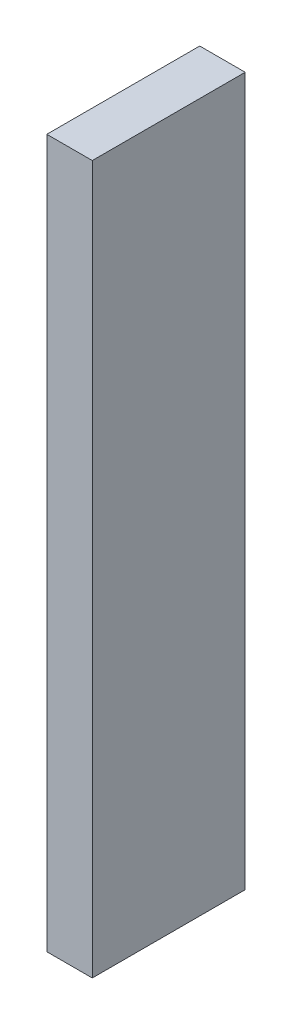
ISO-10303-21;
HEADER;
FILE_DESCRIPTION(('STEP AP214'),'2;1');
FILE_NAME('part.step','',(''),(''),'','','');
FILE_SCHEMA(('AUTOMOTIVE_DESIGN { 1 0 10303 214 1 1 1 1 }'));
ENDSEC;
DATA;
#1=APPLICATION_CONTEXT('core data for automotive mechanical design processes');
#2=APPLICATION_PROTOCOL_DEFINITION('international standard','automotive_design',2000,#1);
#3=PRODUCT_CONTEXT('',#1,'mechanical');
#4=PRODUCT('Part','Part','',(#3));
#5=PRODUCT_RELATED_PRODUCT_CATEGORY('part','',(#4));
#6=PRODUCT_DEFINITION_FORMATION('','',#4);
#7=PRODUCT_DEFINITION_CONTEXT('part definition',#1,'design');
#8=PRODUCT_DEFINITION('design','',#6,#7);
#9=PRODUCT_DEFINITION_SHAPE('','',#8);
#10=(LENGTH_UNIT() NAMED_UNIT(*) SI_UNIT(.MILLI.,.METRE.));
#11=(NAMED_UNIT(*) PLANE_ANGLE_UNIT() SI_UNIT($,.RADIAN.));
#12=(NAMED_UNIT(*) SI_UNIT($,.STERADIAN.) SOLID_ANGLE_UNIT());
#13=UNCERTAINTY_MEASURE_WITH_UNIT(LENGTH_MEASURE(1.E-05),#10,'distance_accuracy_value','');
#14=(GEOMETRIC_REPRESENTATION_CONTEXT(3) GLOBAL_UNCERTAINTY_ASSIGNED_CONTEXT((#13)) GLOBAL_UNIT_ASSIGNED_CONTEXT((#10,
#11,#12)) REPRESENTATION_CONTEXT('',''));
#15=CARTESIAN_POINT('',(0.,0.,0.));
#16=DIRECTION('',(0.,0.,1.));
#17=DIRECTION('',(1.,0.,0.));
#18=AXIS2_PLACEMENT_3D('',#15,#16,#17);
#19=CARTESIAN_POINT('',(130.27554517863,22.4180708263693,106.072024477607));
#20=DIRECTION('',(-1.69244514382854E-09,0.,1.));
#21=DIRECTION('',(1.,0.,1.69244514382854E-09));
#22=AXIS2_PLACEMENT_3D('',#19,#20,#21);
#23=PLANE('',#22);
#24=DIRECTION('',(0.,-1.,0.));
#25=VECTOR('',#24,1.);
#26=CARTESIAN_POINT('',(131.258630275643,22.4180708263693,106.072024479271));
#27=LINE('',#26,#25);
#28=CARTESIAN_POINT('',(131.258630275643,22.4180708263693,106.072024479271));
#29=VERTEX_POINT('',#28);
#30=CARTESIAN_POINT('',(131.258630275643,7.11212965552236,106.072024479271));
#31=VERTEX_POINT('',#30);
#32=EDGE_CURVE('E79',#29,#31,#27,.T.);
#33=ORIENTED_EDGE('',*,*,#32,.F.);
#34=DIRECTION('',(1.,0.,1.69244514382854E-09));
#35=VECTOR('',#34,1.);
#36=CARTESIAN_POINT('',(130.27554517863,22.4180708263693,106.072024477607));
#37=LINE('',#36,#35);
#38=CARTESIAN_POINT('',(130.27554517863,22.4180708263693,106.072024477607));
#39=VERTEX_POINT('',#38);
#40=EDGE_CURVE('E32',#39,#29,#37,.T.);
#41=ORIENTED_EDGE('',*,*,#40,.F.);
#42=DIRECTION('',(0.,-1.,0.));
#43=VECTOR('',#42,1.);
#44=CARTESIAN_POINT('',(130.27554517863,22.4180708263693,106.072024477607));
#45=LINE('',#44,#43);
#46=CARTESIAN_POINT('',(130.27554517863,7.11212965552236,106.072024477607));
#47=VERTEX_POINT('',#46);
#48=EDGE_CURVE('E71',#39,#47,#45,.T.);
#49=ORIENTED_EDGE('',*,*,#48,.T.);
#50=DIRECTION('',(1.,0.,1.69244514382854E-09));
#51=VECTOR('',#50,1.);
#52=CARTESIAN_POINT('',(130.27554517863,7.11212965552236,106.072024477607));
#53=LINE('',#52,#51);
#54=EDGE_CURVE('E10',#47,#31,#53,.T.);
#55=ORIENTED_EDGE('',*,*,#54,.T.);
#56=EDGE_LOOP('',(#33,#41,#49,#55));
#57=FACE_BOUND('',#56,.T.);
#58=ADVANCED_FACE('F16',(#57),#23,.T.);
#59=CARTESIAN_POINT('',(130.27554517863,7.11212965552236,106.072024477607));
#60=DIRECTION('',(0.,-1.,0.));
#61=DIRECTION('',(0.,0.,-1.));
#62=AXIS2_PLACEMENT_3D('',#59,#60,#61);
#63=PLANE('',#62);
#64=DIRECTION('',(1.69244514382854E-09,0.,-1.));
#65=VECTOR('',#64,1.);
#66=CARTESIAN_POINT('',(131.258630275643,7.11212965552236,106.072024479271));
#67=LINE('',#66,#65);
#68=CARTESIAN_POINT('',(131.258630281238,7.11212965552235,102.766083308422));
#69=VERTEX_POINT('',#68);
#70=EDGE_CURVE('E82',#31,#69,#67,.T.);
#71=ORIENTED_EDGE('',*,*,#70,.F.);
#72=ORIENTED_EDGE('',*,*,#54,.F.);
#73=DIRECTION('',(1.69244514382854E-09,0.,-1.));
#74=VECTOR('',#73,1.);
#75=CARTESIAN_POINT('',(130.27554517863,7.11212965552236,106.072024477607));
#76=LINE('',#75,#74);
#77=CARTESIAN_POINT('',(130.275545184225,7.11212965552235,102.766083306758));
#78=VERTEX_POINT('',#77);
#79=EDGE_CURVE('E67',#47,#78,#76,.T.);
#80=ORIENTED_EDGE('',*,*,#79,.T.);
#81=DIRECTION('',(1.,0.,1.69244514382854E-09));
#82=VECTOR('',#81,1.);
#83=CARTESIAN_POINT('',(130.275545184225,7.11212965552235,102.766083306758));
#84=LINE('',#83,#82);
#85=EDGE_CURVE('E24',#78,#69,#84,.T.);
#86=ORIENTED_EDGE('',*,*,#85,.T.);
#87=EDGE_LOOP('',(#71,#72,#80,#86));
#88=FACE_BOUND('',#87,.T.);
#89=ADVANCED_FACE('F68',(#88),#63,.T.);
#90=CARTESIAN_POINT('',(130.275545184225,7.11212965552235,102.766083306758));
#91=DIRECTION('',(1.69244514382854E-09,0.,-1.));
#92=DIRECTION('',(-1.,0.,-1.69244514382854E-09));
#93=AXIS2_PLACEMENT_3D('',#90,#91,#92);
#94=PLANE('',#93);
#95=DIRECTION('',(0.,1.,0.));
#96=VECTOR('',#95,1.);
#97=CARTESIAN_POINT('',(131.258630281238,7.11212965552235,102.766083308422));
#98=LINE('',#97,#96);
#99=CARTESIAN_POINT('',(131.258630281238,22.418070826371,102.766083299961));
#100=VERTEX_POINT('',#99);
#101=EDGE_CURVE('E65',#69,#100,#98,.T.);
#102=ORIENTED_EDGE('',*,*,#101,.F.);
#103=ORIENTED_EDGE('',*,*,#85,.F.);
#104=DIRECTION('',(0.,1.,0.));
#105=VECTOR('',#104,1.);
#106=CARTESIAN_POINT('',(130.275545184225,7.11212965552235,102.766083306758));
#107=LINE('',#106,#105);
#108=CARTESIAN_POINT('',(130.275545184225,22.418070826371,102.766083298297));
#109=VERTEX_POINT('',#108);
#110=EDGE_CURVE('E62',#78,#109,#107,.T.);
#111=ORIENTED_EDGE('',*,*,#110,.T.);
#112=DIRECTION('',(1.,0.,1.69244514382854E-09));
#113=VECTOR('',#112,1.);
#114=CARTESIAN_POINT('',(130.275545184225,22.418070826371,102.766083298297));
#115=LINE('',#114,#113);
#116=EDGE_CURVE('E48',#109,#100,#115,.T.);
#117=ORIENTED_EDGE('',*,*,#116,.T.);
#118=EDGE_LOOP('',(#102,#103,#111,#117));
#119=FACE_BOUND('',#118,.T.);
#120=ADVANCED_FACE('F60',(#119),#94,.T.);
#121=CARTESIAN_POINT('',(130.275545184225,22.418070826371,102.766083298297));
#122=DIRECTION('',(0.,1.,0.));
#123=DIRECTION('',(-1.,0.,0.));
#124=AXIS2_PLACEMENT_3D('',#121,#122,#123);
#125=PLANE('',#124);
#126=DIRECTION('',(-1.69244514382854E-09,0.,1.));
#127=VECTOR('',#126,1.);
#128=CARTESIAN_POINT('',(131.258630281238,22.418070826371,102.766083299961));
#129=LINE('',#128,#127);
#130=EDGE_CURVE('E85',#100,#29,#129,.T.);
#131=ORIENTED_EDGE('',*,*,#130,.F.);
#132=ORIENTED_EDGE('',*,*,#116,.F.);
#133=DIRECTION('',(-1.69244514382854E-09,0.,1.));
#134=VECTOR('',#133,1.);
#135=CARTESIAN_POINT('',(130.275545184225,22.418070826371,102.766083298297));
#136=LINE('',#135,#134);
#137=EDGE_CURVE('E74',#109,#39,#136,.T.);
#138=ORIENTED_EDGE('',*,*,#137,.T.);
#139=ORIENTED_EDGE('',*,*,#40,.T.);
#140=EDGE_LOOP('',(#131,#132,#138,#139));
#141=FACE_BOUND('',#140,.T.);
#142=ADVANCED_FACE('F96',(#141),#125,.T.);
#143=CARTESIAN_POINT('',(130.275545201028,17.2651002409467,92.8378607087388));
#144=DIRECTION('',(1.,0.,1.69244514382854E-09));
#145=DIRECTION('',(0.,1.,0.));
#146=AXIS2_PLACEMENT_3D('',#143,#144,#145);
#147=PLANE('',#146);
#148=ORIENTED_EDGE('',*,*,#48,.F.);
#149=ORIENTED_EDGE('',*,*,#137,.F.);
#150=ORIENTED_EDGE('',*,*,#110,.F.);
#151=ORIENTED_EDGE('',*,*,#79,.F.);
#152=EDGE_LOOP('',(#148,#149,#150,#151));
#153=FACE_BOUND('',#152,.T.);
#154=ADVANCED_FACE('F73',(#153),#147,.F.);
#155=CARTESIAN_POINT('',(131.258630298041,17.2651002409467,92.8378607104026));
#156=DIRECTION('',(1.,0.,1.69244514382854E-09));
#157=DIRECTION('',(0.,1.,0.));
#158=AXIS2_PLACEMENT_3D('',#155,#156,#157);
#159=PLANE('',#158);
#160=ORIENTED_EDGE('',*,*,#32,.T.);
#161=ORIENTED_EDGE('',*,*,#70,.T.);
#162=ORIENTED_EDGE('',*,*,#101,.T.);
#163=ORIENTED_EDGE('',*,*,#130,.T.);
#164=EDGE_LOOP('',(#160,#161,#162,#163));
#165=FACE_BOUND('',#164,.T.);
#166=ADVANCED_FACE('F89',(#165),#159,.T.);
#167=CLOSED_SHELL('',(#58,#89,#120,#142,#154,#166));
#168=MANIFOLD_SOLID_BREP('B1',#167);
#169=ADVANCED_BREP_SHAPE_REPRESENTATION('',(#18,#168),#14);
#170=SHAPE_DEFINITION_REPRESENTATION(#9,#169);
ENDSEC;
END-ISO-10303-21;
